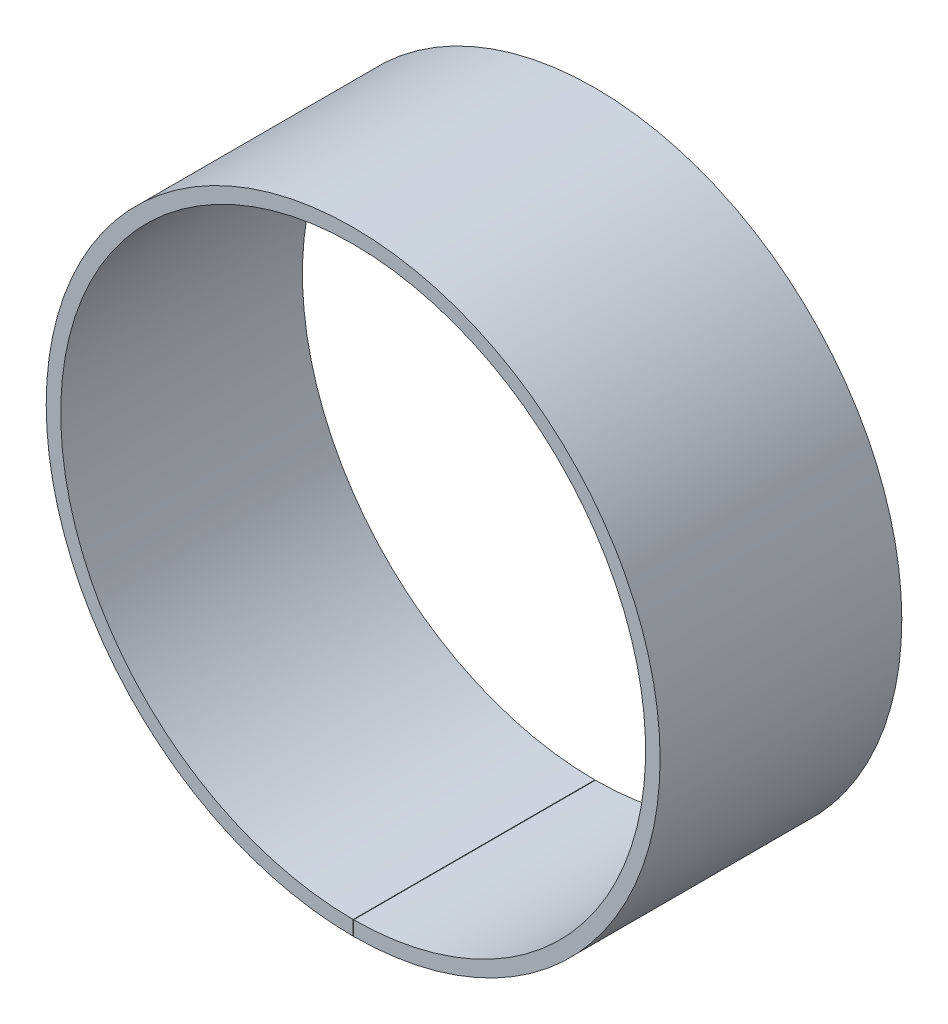
ISO-10303-21;
HEADER;
FILE_DESCRIPTION(('STEP AP214'),'2;1');
FILE_NAME('part.step','',(''),(''),'','','');
FILE_SCHEMA(('AUTOMOTIVE_DESIGN { 1 0 10303 214 1 1 1 1 }'));
ENDSEC;
DATA;
#1=APPLICATION_CONTEXT('core data for automotive mechanical design processes');
#2=APPLICATION_PROTOCOL_DEFINITION('international standard','automotive_design',2000,#1);
#3=PRODUCT_CONTEXT('',#1,'mechanical');
#4=PRODUCT('Part','Part','',(#3));
#5=PRODUCT_RELATED_PRODUCT_CATEGORY('part','',(#4));
#6=PRODUCT_DEFINITION_FORMATION('','',#4);
#7=PRODUCT_DEFINITION_CONTEXT('part definition',#1,'design');
#8=PRODUCT_DEFINITION('design','',#6,#7);
#9=PRODUCT_DEFINITION_SHAPE('','',#8);
#10=(LENGTH_UNIT() NAMED_UNIT(*) SI_UNIT(.MILLI.,.METRE.));
#11=(NAMED_UNIT(*) PLANE_ANGLE_UNIT() SI_UNIT($,.RADIAN.));
#12=(NAMED_UNIT(*) SI_UNIT($,.STERADIAN.) SOLID_ANGLE_UNIT());
#13=UNCERTAINTY_MEASURE_WITH_UNIT(LENGTH_MEASURE(1.E-05),#10,'distance_accuracy_value','');
#14=(GEOMETRIC_REPRESENTATION_CONTEXT(3) GLOBAL_UNCERTAINTY_ASSIGNED_CONTEXT((#13)) GLOBAL_UNIT_ASSIGNED_CONTEXT((#10,
#11,#12)) REPRESENTATION_CONTEXT('',''));
#15=CARTESIAN_POINT('',(0.,0.,0.));
#16=DIRECTION('',(0.,0.,1.));
#17=DIRECTION('',(1.,0.,0.));
#18=AXIS2_PLACEMENT_3D('',#15,#16,#17);
#19=CARTESIAN_POINT('',(0.,0.,50.));
#20=DIRECTION('',(0.,0.,-1.));
#21=DIRECTION('',(-1.,0.,0.));
#22=AXIS2_PLACEMENT_3D('',#19,#20,#21);
#23=CYLINDRICAL_SURFACE('',#22,60.5);
#24=CARTESIAN_POINT('',(0.,0.,0.));
#25=DIRECTION('',(0.,0.,1.));
#26=DIRECTION('',(1.,0.,0.));
#27=AXIS2_PLACEMENT_3D('',#24,#25,#26);
#28=CIRCLE('',#27,60.5);
#29=CARTESIAN_POINT('',(0.,-60.5,0.));
#30=VERTEX_POINT('',#29);
#31=CARTESIAN_POINT('',(0.10559236613683,-60.4999078532539,0.));
#32=VERTEX_POINT('',#31);
#33=EDGE_CURVE('E102',#30,#32,#28,.F.);
#34=ORIENTED_EDGE('',*,*,#33,.T.);
#35=DIRECTION('',(0.,0.,-1.));
#36=VECTOR('',#35,1.);
#37=CARTESIAN_POINT('',(0.10559236613683,-60.4999078532539,50.));
#38=LINE('',#37,#36);
#39=CARTESIAN_POINT('',(0.10559236613683,-60.4999078532539,50.));
#40=VERTEX_POINT('',#39);
#41=EDGE_CURVE('E11',#40,#32,#38,.T.);
#42=ORIENTED_EDGE('',*,*,#41,.F.);
#43=CARTESIAN_POINT('',(0.,0.,50.));
#44=DIRECTION('',(0.,0.,1.));
#45=DIRECTION('',(1.,0.,0.));
#46=AXIS2_PLACEMENT_3D('',#43,#44,#45);
#47=CIRCLE('',#46,60.5);
#48=CARTESIAN_POINT('',(0.,-60.5,50.));
#49=VERTEX_POINT('',#48);
#50=EDGE_CURVE('E79',#49,#40,#47,.F.);
#51=ORIENTED_EDGE('',*,*,#50,.F.);
#52=DIRECTION('',(0.,0.,-1.));
#53=VECTOR('',#52,1.);
#54=CARTESIAN_POINT('',(0.,-60.5,50.));
#55=LINE('',#54,#53);
#56=EDGE_CURVE('E55',#49,#30,#55,.T.);
#57=ORIENTED_EDGE('',*,*,#56,.T.);
#58=EDGE_LOOP('',(#34,#42,#51,#57));
#59=FACE_BOUND('',#58,.T.);
#60=ADVANCED_FACE('F39',(#59),#23,.F.);
#61=CARTESIAN_POINT('',(0.110828351234547,-63.4999032839938,50.));
#62=DIRECTION('',(-0.999998476913288,-0.00174532836590579,0.));
#63=DIRECTION('',(0.00174532836590579,-0.999998476913288,0.));
#64=AXIS2_PLACEMENT_3D('',#61,#62,#63);
#65=PLANE('',#64);
#66=DIRECTION('',(-0.00174532836590579,0.999998476913288,0.));
#67=VECTOR('',#66,1.);
#68=CARTESIAN_POINT('',(0.110828351234547,-63.4999032839938,0.));
#69=LINE('',#68,#67);
#70=CARTESIAN_POINT('',(0.110828351234547,-63.4999032839938,0.));
#71=VERTEX_POINT('',#70);
#72=EDGE_CURVE('E88',#71,#32,#69,.T.);
#73=ORIENTED_EDGE('',*,*,#72,.F.);
#74=DIRECTION('',(0.,0.,-1.));
#75=VECTOR('',#74,1.);
#76=CARTESIAN_POINT('',(0.110828351234547,-63.4999032839938,50.));
#77=LINE('',#76,#75);
#78=CARTESIAN_POINT('',(0.110828351234547,-63.4999032839938,50.));
#79=VERTEX_POINT('',#78);
#80=EDGE_CURVE('E47',#79,#71,#77,.T.);
#81=ORIENTED_EDGE('',*,*,#80,.F.);
#82=DIRECTION('',(-0.00174532836590579,0.999998476913288,0.));
#83=VECTOR('',#82,1.);
#84=CARTESIAN_POINT('',(0.110828351234547,-63.4999032839938,50.));
#85=LINE('',#84,#83);
#86=EDGE_CURVE('E86',#79,#40,#85,.T.);
#87=ORIENTED_EDGE('',*,*,#86,.T.);
#88=ORIENTED_EDGE('',*,*,#41,.T.);
#89=EDGE_LOOP('',(#73,#81,#87,#88));
#90=FACE_BOUND('',#89,.T.);
#91=ADVANCED_FACE('F85',(#90),#65,.T.);
#92=CARTESIAN_POINT('',(0.,0.,50.));
#93=DIRECTION('',(0.,0.,-1.));
#94=DIRECTION('',(-1.,0.,0.));
#95=AXIS2_PLACEMENT_3D('',#92,#93,#94);
#96=CYLINDRICAL_SURFACE('',#95,63.5);
#97=CARTESIAN_POINT('',(0.,0.,0.));
#98=DIRECTION('',(0.,0.,-1.));
#99=DIRECTION('',(-1.,0.,0.));
#100=AXIS2_PLACEMENT_3D('',#97,#98,#99);
#101=CIRCLE('',#100,63.5);
#102=CARTESIAN_POINT('',(0.,-63.5,0.));
#103=VERTEX_POINT('',#102);
#104=EDGE_CURVE('E105',#103,#71,#101,.T.);
#105=ORIENTED_EDGE('',*,*,#104,.F.);
#106=DIRECTION('',(0.,0.,-1.));
#107=VECTOR('',#106,1.);
#108=CARTESIAN_POINT('',(0.,-63.5,50.));
#109=LINE('',#108,#107);
#110=CARTESIAN_POINT('',(0.,-63.5,50.));
#111=VERTEX_POINT('',#110);
#112=EDGE_CURVE('E68',#111,#103,#109,.T.);
#113=ORIENTED_EDGE('',*,*,#112,.F.);
#114=CARTESIAN_POINT('',(0.,0.,50.));
#115=DIRECTION('',(0.,0.,-1.));
#116=DIRECTION('',(-1.,0.,0.));
#117=AXIS2_PLACEMENT_3D('',#114,#115,#116);
#118=CIRCLE('',#117,63.5);
#119=EDGE_CURVE('E94',#111,#79,#118,.T.);
#120=ORIENTED_EDGE('',*,*,#119,.T.);
#121=ORIENTED_EDGE('',*,*,#80,.T.);
#122=EDGE_LOOP('',(#105,#113,#120,#121));
#123=FACE_BOUND('',#122,.T.);
#124=ADVANCED_FACE('F96',(#123),#96,.T.);
#125=CARTESIAN_POINT('',(0.,-60.5,50.));
#126=DIRECTION('',(1.,0.,0.));
#127=DIRECTION('',(0.,1.,0.));
#128=AXIS2_PLACEMENT_3D('',#125,#126,#127);
#129=PLANE('',#128);
#130=DIRECTION('',(0.,-1.,0.));
#131=VECTOR('',#130,1.);
#132=CARTESIAN_POINT('',(0.,-60.5,0.));
#133=LINE('',#132,#131);
#134=EDGE_CURVE('E107',#30,#103,#133,.T.);
#135=ORIENTED_EDGE('',*,*,#134,.F.);
#136=ORIENTED_EDGE('',*,*,#56,.F.);
#137=DIRECTION('',(0.,-1.,0.));
#138=VECTOR('',#137,1.);
#139=CARTESIAN_POINT('',(0.,-60.5,50.));
#140=LINE('',#139,#138);
#141=EDGE_CURVE('E97',#49,#111,#140,.T.);
#142=ORIENTED_EDGE('',*,*,#141,.T.);
#143=ORIENTED_EDGE('',*,*,#112,.T.);
#144=EDGE_LOOP('',(#135,#136,#142,#143));
#145=FACE_BOUND('',#144,.T.);
#146=ADVANCED_FACE('F113',(#145),#129,.T.);
#147=CARTESIAN_POINT('',(0.,0.,50.));
#148=DIRECTION('',(0.,0.,1.));
#149=DIRECTION('',(1.,0.,0.));
#150=AXIS2_PLACEMENT_3D('',#147,#148,#149);
#151=PLANE('',#150);
#152=ORIENTED_EDGE('',*,*,#50,.T.);
#153=ORIENTED_EDGE('',*,*,#86,.F.);
#154=ORIENTED_EDGE('',*,*,#119,.F.);
#155=ORIENTED_EDGE('',*,*,#141,.F.);
#156=EDGE_LOOP('',(#152,#153,#154,#155));
#157=FACE_BOUND('',#156,.T.);
#158=ADVANCED_FACE('F93',(#157),#151,.T.);
#159=CARTESIAN_POINT('',(0.,0.,0.));
#160=DIRECTION('',(0.,0.,1.));
#161=DIRECTION('',(1.,0.,0.));
#162=AXIS2_PLACEMENT_3D('',#159,#160,#161);
#163=PLANE('',#162);
#164=ORIENTED_EDGE('',*,*,#33,.F.);
#165=ORIENTED_EDGE('',*,*,#134,.T.);
#166=ORIENTED_EDGE('',*,*,#104,.T.);
#167=ORIENTED_EDGE('',*,*,#72,.T.);
#168=EDGE_LOOP('',(#164,#165,#166,#167));
#169=FACE_BOUND('',#168,.T.);
#170=ADVANCED_FACE('F112',(#169),#163,.F.);
#171=CLOSED_SHELL('',(#60,#91,#124,#146,#158,#170));
#172=MANIFOLD_SOLID_BREP('B2',#171);
#173=ADVANCED_BREP_SHAPE_REPRESENTATION('',(#18,#172),#14);
#174=SHAPE_DEFINITION_REPRESENTATION(#9,#173);
ENDSEC;
END-ISO-10303-21;
